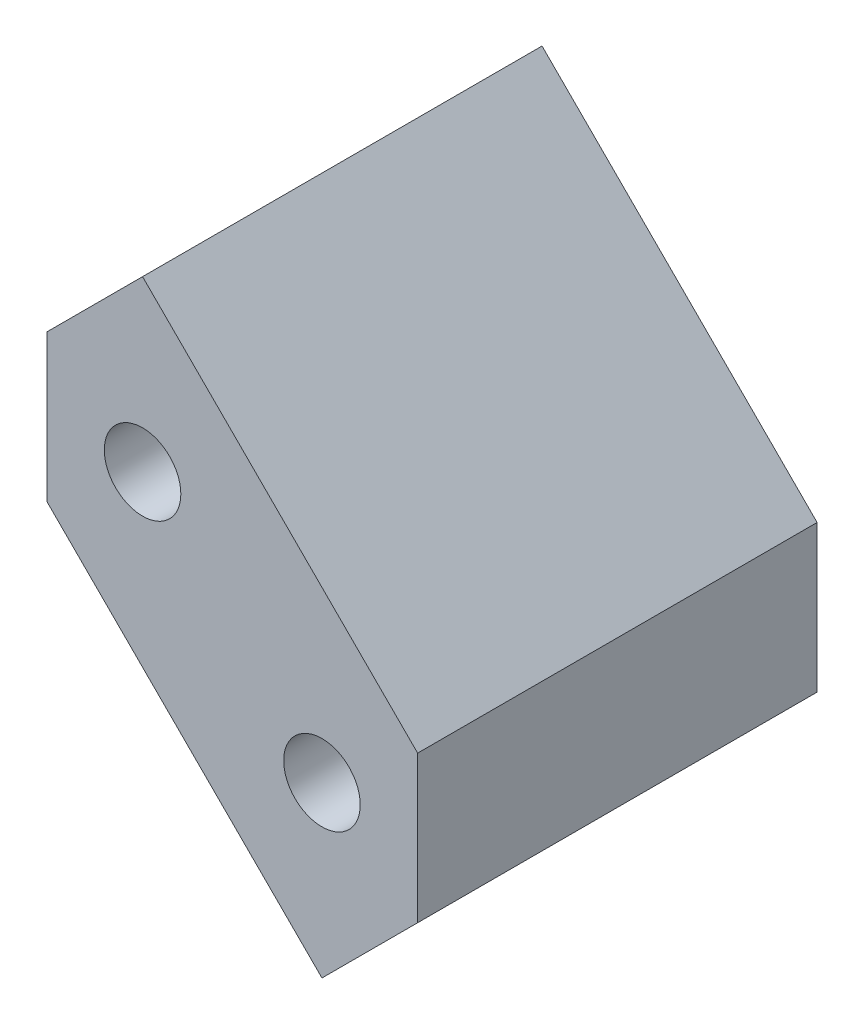
ISO-10303-21;
HEADER;
FILE_DESCRIPTION(('STEP AP214'),'2;1');
FILE_NAME('part.step','',(''),(''),'','','');
FILE_SCHEMA(('AUTOMOTIVE_DESIGN { 1 0 10303 214 1 1 1 1 }'));
ENDSEC;
DATA;
#1=APPLICATION_CONTEXT('core data for automotive mechanical design processes');
#2=APPLICATION_PROTOCOL_DEFINITION('international standard','automotive_design',2000,#1);
#3=PRODUCT_CONTEXT('',#1,'mechanical');
#4=PRODUCT('Part','Part','',(#3));
#5=PRODUCT_RELATED_PRODUCT_CATEGORY('part','',(#4));
#6=PRODUCT_DEFINITION_FORMATION('','',#4);
#7=PRODUCT_DEFINITION_CONTEXT('part definition',#1,'design');
#8=PRODUCT_DEFINITION('design','',#6,#7);
#9=PRODUCT_DEFINITION_SHAPE('','',#8);
#10=(LENGTH_UNIT() NAMED_UNIT(*) SI_UNIT(.MILLI.,.METRE.));
#11=(NAMED_UNIT(*) PLANE_ANGLE_UNIT() SI_UNIT($,.RADIAN.));
#12=(NAMED_UNIT(*) SI_UNIT($,.STERADIAN.) SOLID_ANGLE_UNIT());
#13=UNCERTAINTY_MEASURE_WITH_UNIT(LENGTH_MEASURE(1.E-05),#10,'distance_accuracy_value','');
#14=(GEOMETRIC_REPRESENTATION_CONTEXT(3) GLOBAL_UNCERTAINTY_ASSIGNED_CONTEXT((#13)) GLOBAL_UNIT_ASSIGNED_CONTEXT((#10,
#11,#12)) REPRESENTATION_CONTEXT('',''));
#15=CARTESIAN_POINT('',(0.,0.,0.));
#16=DIRECTION('',(0.,0.,1.));
#17=DIRECTION('',(1.,0.,0.));
#18=AXIS2_PLACEMENT_3D('',#15,#16,#17);
#19=CARTESIAN_POINT('',(3.53553390593274,3.53553390593278,16.7));
#20=DIRECTION('',(-0.707106781186544,-0.707106781186551,0.));
#21=DIRECTION('',(0.707106781186551,-0.707106781186544,0.));
#22=AXIS2_PLACEMENT_3D('',#19,#20,#21);
#23=PLANE('',#22);
#24=DIRECTION('',(-0.707106781186551,0.707106781186544,0.));
#25=VECTOR('',#24,1.);
#26=CARTESIAN_POINT('',(3.53553390593274,3.53553390593278,0.));
#27=LINE('',#26,#25);
#28=CARTESIAN_POINT('',(7.75,-0.678932188134435,0.));
#29=VERTEX_POINT('',#28);
#30=CARTESIAN_POINT('',(-3.75000000000004,10.8210678118655,0.));
#31=VERTEX_POINT('',#30);
#32=EDGE_CURVE('E125',#29,#31,#27,.T.);
#33=ORIENTED_EDGE('',*,*,#32,.T.);
#34=DIRECTION('',(0.,0.,-1.));
#35=VECTOR('',#34,1.);
#36=CARTESIAN_POINT('',(-3.75000000000004,10.8210678118655,16.7));
#37=LINE('',#36,#35);
#38=CARTESIAN_POINT('',(-3.75000000000004,10.8210678118655,16.7));
#39=VERTEX_POINT('',#38);
#40=EDGE_CURVE('E11',#39,#31,#37,.T.);
#41=ORIENTED_EDGE('',*,*,#40,.F.);
#42=DIRECTION('',(-0.707106781186551,0.707106781186544,0.));
#43=VECTOR('',#42,1.);
#44=CARTESIAN_POINT('',(3.53553390593274,3.53553390593278,16.7));
#45=LINE('',#44,#43);
#46=CARTESIAN_POINT('',(7.75,-0.678932188134435,16.7));
#47=VERTEX_POINT('',#46);
#48=EDGE_CURVE('E143',#47,#39,#45,.T.);
#49=ORIENTED_EDGE('',*,*,#48,.F.);
#50=DIRECTION('',(0.,0.,-1.));
#51=VECTOR('',#50,1.);
#52=CARTESIAN_POINT('',(7.75,-0.678932188134435,16.7));
#53=LINE('',#52,#51);
#54=EDGE_CURVE('E49',#47,#29,#53,.T.);
#55=ORIENTED_EDGE('',*,*,#54,.T.);
#56=EDGE_LOOP('',(#33,#41,#49,#55));
#57=FACE_BOUND('',#56,.T.);
#58=ADVANCED_FACE('F33',(#57),#23,.F.);
#59=CARTESIAN_POINT('',(-7.28553390593278,7.2855339059327,16.7));
#60=DIRECTION('',(0.707106781186551,-0.707106781186544,0.));
#61=DIRECTION('',(0.707106781186544,0.707106781186551,0.));
#62=AXIS2_PLACEMENT_3D('',#59,#60,#61);
#63=PLANE('',#62);
#64=DIRECTION('',(-0.707106781186544,-0.707106781186551,0.));
#65=VECTOR('',#64,1.);
#66=CARTESIAN_POINT('',(-7.28553390593278,7.2855339059327,0.));
#67=LINE('',#66,#65);
#68=CARTESIAN_POINT('',(-7.75,6.82106781186547,0.));
#69=VERTEX_POINT('',#68);
#70=EDGE_CURVE('E127',#31,#69,#67,.T.);
#71=ORIENTED_EDGE('',*,*,#70,.T.);
#72=DIRECTION('',(0.,0.,-1.));
#73=VECTOR('',#72,1.);
#74=CARTESIAN_POINT('',(-7.75,6.82106781186547,16.7));
#75=LINE('',#74,#73);
#76=CARTESIAN_POINT('',(-7.75,6.82106781186547,16.7));
#77=VERTEX_POINT('',#76);
#78=EDGE_CURVE('E41',#77,#69,#75,.T.);
#79=ORIENTED_EDGE('',*,*,#78,.F.);
#80=DIRECTION('',(-0.707106781186544,-0.707106781186551,0.));
#81=VECTOR('',#80,1.);
#82=CARTESIAN_POINT('',(-7.28553390593278,7.2855339059327,16.7));
#83=LINE('',#82,#81);
#84=EDGE_CURVE('E82',#39,#77,#83,.T.);
#85=ORIENTED_EDGE('',*,*,#84,.F.);
#86=ORIENTED_EDGE('',*,*,#40,.T.);
#87=EDGE_LOOP('',(#71,#79,#85,#86));
#88=FACE_BOUND('',#87,.T.);
#89=ADVANCED_FACE('F168',(#88),#63,.F.);
#90=CARTESIAN_POINT('',(-7.75,0.,16.7));
#91=DIRECTION('',(1.,0.,0.));
#92=DIRECTION('',(0.,1.,0.));
#93=AXIS2_PLACEMENT_3D('',#90,#91,#92);
#94=PLANE('',#93);
#95=DIRECTION('',(0.,-1.,0.));
#96=VECTOR('',#95,1.);
#97=CARTESIAN_POINT('',(-7.75,0.,0.));
#98=LINE('',#97,#96);
#99=CARTESIAN_POINT('',(-7.75,0.678932188134518,0.));
#100=VERTEX_POINT('',#99);
#101=EDGE_CURVE('E129',#69,#100,#98,.T.);
#102=ORIENTED_EDGE('',*,*,#101,.T.);
#103=DIRECTION('',(0.,0.,-1.));
#104=VECTOR('',#103,1.);
#105=CARTESIAN_POINT('',(-7.75,0.678932188134518,16.7));
#106=LINE('',#105,#104);
#107=CARTESIAN_POINT('',(-7.75,0.678932188134518,16.7));
#108=VERTEX_POINT('',#107);
#109=EDGE_CURVE('E111',#108,#100,#106,.T.);
#110=ORIENTED_EDGE('',*,*,#109,.F.);
#111=DIRECTION('',(0.,-1.,0.));
#112=VECTOR('',#111,1.);
#113=CARTESIAN_POINT('',(-7.75,0.,16.7));
#114=LINE('',#113,#112);
#115=EDGE_CURVE('E99',#77,#108,#114,.T.);
#116=ORIENTED_EDGE('',*,*,#115,.F.);
#117=ORIENTED_EDGE('',*,*,#78,.T.);
#118=EDGE_LOOP('',(#102,#110,#116,#117));
#119=FACE_BOUND('',#118,.T.);
#120=ADVANCED_FACE('F149',(#119),#94,.F.);
#121=CARTESIAN_POINT('',(-3.5355339059327,-3.53553390593274,16.7));
#122=DIRECTION('',(0.707106781186543,0.707106781186552,0.));
#123=DIRECTION('',(-0.707106781186552,0.707106781186543,0.));
#124=AXIS2_PLACEMENT_3D('',#121,#122,#123);
#125=PLANE('',#124);
#126=DIRECTION('',(0.707106781186552,-0.707106781186543,0.));
#127=VECTOR('',#126,1.);
#128=CARTESIAN_POINT('',(-3.5355339059327,-3.53553390593274,0.));
#129=LINE('',#128,#127);
#130=CARTESIAN_POINT('',(3.75000000000008,-10.8210678118654,0.));
#131=VERTEX_POINT('',#130);
#132=EDGE_CURVE('E108',#100,#131,#129,.T.);
#133=ORIENTED_EDGE('',*,*,#132,.T.);
#134=DIRECTION('',(0.,0.,-1.));
#135=VECTOR('',#134,1.);
#136=CARTESIAN_POINT('',(3.75000000000008,-10.8210678118654,16.7));
#137=LINE('',#136,#135);
#138=CARTESIAN_POINT('',(3.75000000000008,-10.8210678118654,16.7));
#139=VERTEX_POINT('',#138);
#140=EDGE_CURVE('E105',#139,#131,#137,.T.);
#141=ORIENTED_EDGE('',*,*,#140,.F.);
#142=DIRECTION('',(0.707106781186552,-0.707106781186543,0.));
#143=VECTOR('',#142,1.);
#144=CARTESIAN_POINT('',(-3.5355339059327,-3.53553390593274,16.7));
#145=LINE('',#144,#143);
#146=EDGE_CURVE('E91',#108,#139,#145,.T.);
#147=ORIENTED_EDGE('',*,*,#146,.F.);
#148=ORIENTED_EDGE('',*,*,#109,.T.);
#149=EDGE_LOOP('',(#133,#141,#147,#148));
#150=FACE_BOUND('',#149,.T.);
#151=ADVANCED_FACE('F106',(#150),#125,.F.);
#152=CARTESIAN_POINT('',(7.28553390593278,-7.2855339059327,16.7));
#153=DIRECTION('',(-0.707106781186552,0.707106781186543,0.));
#154=DIRECTION('',(-0.707106781186543,-0.707106781186552,0.));
#155=AXIS2_PLACEMENT_3D('',#152,#153,#154);
#156=PLANE('',#155);
#157=DIRECTION('',(0.707106781186543,0.707106781186552,0.));
#158=VECTOR('',#157,1.);
#159=CARTESIAN_POINT('',(7.28553390593278,-7.2855339059327,0.));
#160=LINE('',#159,#158);
#161=CARTESIAN_POINT('',(7.75,-6.82106781186547,0.));
#162=VERTEX_POINT('',#161);
#163=EDGE_CURVE('E132',#131,#162,#160,.T.);
#164=ORIENTED_EDGE('',*,*,#163,.T.);
#165=DIRECTION('',(0.,0.,-1.));
#166=VECTOR('',#165,1.);
#167=CARTESIAN_POINT('',(7.75,-6.82106781186547,16.7));
#168=LINE('',#167,#166);
#169=CARTESIAN_POINT('',(7.75,-6.82106781186547,16.7));
#170=VERTEX_POINT('',#169);
#171=EDGE_CURVE('E70',#170,#162,#168,.T.);
#172=ORIENTED_EDGE('',*,*,#171,.F.);
#173=DIRECTION('',(0.707106781186543,0.707106781186552,0.));
#174=VECTOR('',#173,1.);
#175=CARTESIAN_POINT('',(7.28553390593278,-7.2855339059327,16.7));
#176=LINE('',#175,#174);
#177=EDGE_CURVE('E97',#139,#170,#176,.T.);
#178=ORIENTED_EDGE('',*,*,#177,.F.);
#179=ORIENTED_EDGE('',*,*,#140,.T.);
#180=EDGE_LOOP('',(#164,#172,#178,#179));
#181=FACE_BOUND('',#180,.T.);
#182=ADVANCED_FACE('F113',(#181),#156,.F.);
#183=CARTESIAN_POINT('',(-3.75,3.75,16.7));
#184=DIRECTION('',(0.,0.,-1.));
#185=DIRECTION('',(-1.,0.,0.));
#186=AXIS2_PLACEMENT_3D('',#183,#184,#185);
#187=CYLINDRICAL_SURFACE('',#186,1.6);
#188=CARTESIAN_POINT('',(-3.75,3.75,16.7));
#189=DIRECTION('',(0.,0.,1.));
#190=DIRECTION('',(1.,0.,0.));
#191=AXIS2_PLACEMENT_3D('',#188,#189,#190);
#192=CIRCLE('',#191,1.6);
#193=CARTESIAN_POINT('',(-2.15,3.75,16.7));
#194=VERTEX_POINT('',#193);
#195=EDGE_CURVE('E116',#194,#194,#192,.T.);
#196=ORIENTED_EDGE('',*,*,#195,.T.);
#197=EDGE_LOOP('',(#196));
#198=FACE_BOUND('',#197,.T.);
#199=CARTESIAN_POINT('',(-3.75,3.75,0.));
#200=DIRECTION('',(0.,0.,1.));
#201=DIRECTION('',(1.,0.,0.));
#202=AXIS2_PLACEMENT_3D('',#199,#200,#201);
#203=CIRCLE('',#202,1.6);
#204=CARTESIAN_POINT('',(-2.15,3.75,0.));
#205=VERTEX_POINT('',#204);
#206=EDGE_CURVE('E137',#205,#205,#203,.T.);
#207=ORIENTED_EDGE('',*,*,#206,.F.);
#208=EDGE_LOOP('',(#207));
#209=FACE_BOUND('',#208,.T.);
#210=ADVANCED_FACE('F156',(#198,#209),#187,.F.);
#211=CARTESIAN_POINT('',(7.75,0.,16.7));
#212=DIRECTION('',(1.,0.,0.));
#213=DIRECTION('',(0.,1.,0.));
#214=AXIS2_PLACEMENT_3D('',#211,#212,#213);
#215=PLANE('',#214);
#216=DIRECTION('',(0.,-1.,0.));
#217=VECTOR('',#216,1.);
#218=CARTESIAN_POINT('',(7.75,0.,0.));
#219=LINE('',#218,#217);
#220=EDGE_CURVE('E134',#29,#162,#219,.T.);
#221=ORIENTED_EDGE('',*,*,#220,.F.);
#222=ORIENTED_EDGE('',*,*,#54,.F.);
#223=DIRECTION('',(0.,-1.,0.));
#224=VECTOR('',#223,1.);
#225=CARTESIAN_POINT('',(7.75,0.,16.7));
#226=LINE('',#225,#224);
#227=EDGE_CURVE('E114',#47,#170,#226,.T.);
#228=ORIENTED_EDGE('',*,*,#227,.T.);
#229=ORIENTED_EDGE('',*,*,#171,.T.);
#230=EDGE_LOOP('',(#221,#222,#228,#229));
#231=FACE_BOUND('',#230,.T.);
#232=ADVANCED_FACE('F153',(#231),#215,.T.);
#233=CARTESIAN_POINT('',(3.75,-3.75,16.7));
#234=DIRECTION('',(0.,0.,-1.));
#235=DIRECTION('',(-1.,0.,0.));
#236=AXIS2_PLACEMENT_3D('',#233,#234,#235);
#237=CYLINDRICAL_SURFACE('',#236,1.6);
#238=CARTESIAN_POINT('',(3.75,-3.75,16.7));
#239=DIRECTION('',(0.,0.,1.));
#240=DIRECTION('',(1.,0.,0.));
#241=AXIS2_PLACEMENT_3D('',#238,#239,#240);
#242=CIRCLE('',#241,1.6);
#243=CARTESIAN_POINT('',(5.35,-3.75,16.7));
#244=VERTEX_POINT('',#243);
#245=EDGE_CURVE('E122',#244,#244,#242,.T.);
#246=ORIENTED_EDGE('',*,*,#245,.T.);
#247=EDGE_LOOP('',(#246));
#248=FACE_BOUND('',#247,.T.);
#249=CARTESIAN_POINT('',(3.75,-3.75,0.));
#250=DIRECTION('',(0.,0.,1.));
#251=DIRECTION('',(1.,0.,0.));
#252=AXIS2_PLACEMENT_3D('',#249,#250,#251);
#253=CIRCLE('',#252,1.6);
#254=CARTESIAN_POINT('',(5.35,-3.75,0.));
#255=VERTEX_POINT('',#254);
#256=EDGE_CURVE('E140',#255,#255,#253,.T.);
#257=ORIENTED_EDGE('',*,*,#256,.F.);
#258=EDGE_LOOP('',(#257));
#259=FACE_BOUND('',#258,.T.);
#260=ADVANCED_FACE('F155',(#248,#259),#237,.F.);
#261=CARTESIAN_POINT('',(0.,0.,16.7));
#262=DIRECTION('',(0.,0.,1.));
#263=DIRECTION('',(1.,0.,0.));
#264=AXIS2_PLACEMENT_3D('',#261,#262,#263);
#265=PLANE('',#264);
#266=ORIENTED_EDGE('',*,*,#48,.T.);
#267=ORIENTED_EDGE('',*,*,#84,.T.);
#268=ORIENTED_EDGE('',*,*,#115,.T.);
#269=ORIENTED_EDGE('',*,*,#146,.T.);
#270=ORIENTED_EDGE('',*,*,#177,.T.);
#271=ORIENTED_EDGE('',*,*,#227,.F.);
#272=EDGE_LOOP('',(#266,#267,#268,#269,#270,#271));
#273=FACE_BOUND('',#272,.T.);
#274=ORIENTED_EDGE('',*,*,#195,.F.);
#275=EDGE_LOOP('',(#274));
#276=FACE_BOUND('',#275,.T.);
#277=ORIENTED_EDGE('',*,*,#245,.F.);
#278=EDGE_LOOP('',(#277));
#279=FACE_BOUND('',#278,.T.);
#280=ADVANCED_FACE('F93',(#273,#276,#279),#265,.T.);
#281=CARTESIAN_POINT('',(0.,0.,0.));
#282=DIRECTION('',(0.,0.,1.));
#283=DIRECTION('',(1.,0.,0.));
#284=AXIS2_PLACEMENT_3D('',#281,#282,#283);
#285=PLANE('',#284);
#286=ORIENTED_EDGE('',*,*,#32,.F.);
#287=ORIENTED_EDGE('',*,*,#220,.T.);
#288=ORIENTED_EDGE('',*,*,#163,.F.);
#289=ORIENTED_EDGE('',*,*,#132,.F.);
#290=ORIENTED_EDGE('',*,*,#101,.F.);
#291=ORIENTED_EDGE('',*,*,#70,.F.);
#292=EDGE_LOOP('',(#286,#287,#288,#289,#290,#291));
#293=FACE_BOUND('',#292,.T.);
#294=ORIENTED_EDGE('',*,*,#206,.T.);
#295=EDGE_LOOP('',(#294));
#296=FACE_BOUND('',#295,.T.);
#297=ORIENTED_EDGE('',*,*,#256,.T.);
#298=EDGE_LOOP('',(#297));
#299=FACE_BOUND('',#298,.T.);
#300=ADVANCED_FACE('F151',(#293,#296,#299),#285,.F.);
#301=CLOSED_SHELL('',(#58,#89,#120,#151,#182,#210,#232,#260,#280,#300));
#302=MANIFOLD_SOLID_BREP('B2',#301);
#303=ADVANCED_BREP_SHAPE_REPRESENTATION('',(#18,#302),#14);
#304=SHAPE_DEFINITION_REPRESENTATION(#9,#303);
ENDSEC;
END-ISO-10303-21;
